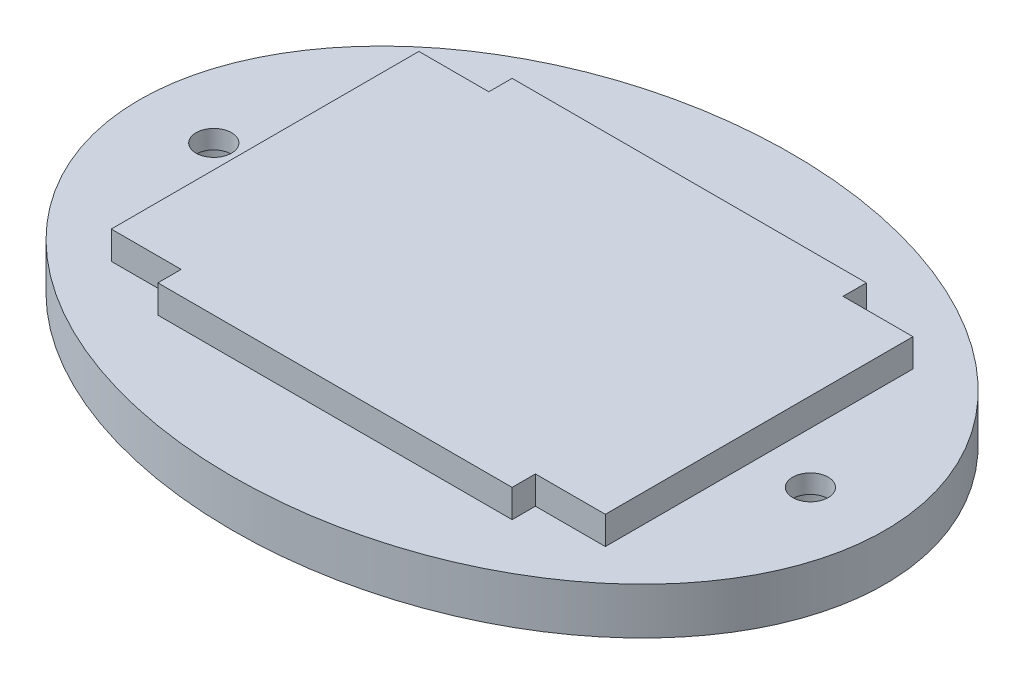
ISO-10303-21;
HEADER;
FILE_DESCRIPTION(('STEP AP214'),'2;1');
FILE_NAME('part.step','',(''),(''),'','','');
FILE_SCHEMA(('AUTOMOTIVE_DESIGN { 1 0 10303 214 1 1 1 1 }'));
ENDSEC;
DATA;
#1=APPLICATION_CONTEXT('core data for automotive mechanical design processes');
#2=APPLICATION_PROTOCOL_DEFINITION('international standard','automotive_design',2000,#1);
#3=PRODUCT_CONTEXT('',#1,'mechanical');
#4=PRODUCT('Part','Part','',(#3));
#5=PRODUCT_RELATED_PRODUCT_CATEGORY('part','',(#4));
#6=PRODUCT_DEFINITION_FORMATION('','',#4);
#7=PRODUCT_DEFINITION_CONTEXT('part definition',#1,'design');
#8=PRODUCT_DEFINITION('design','',#6,#7);
#9=PRODUCT_DEFINITION_SHAPE('','',#8);
#10=(LENGTH_UNIT() NAMED_UNIT(*) SI_UNIT(.MILLI.,.METRE.));
#11=(NAMED_UNIT(*) PLANE_ANGLE_UNIT() SI_UNIT($,.RADIAN.));
#12=(NAMED_UNIT(*) SI_UNIT($,.STERADIAN.) SOLID_ANGLE_UNIT());
#13=UNCERTAINTY_MEASURE_WITH_UNIT(LENGTH_MEASURE(1.E-05),#10,'distance_accuracy_value','');
#14=(GEOMETRIC_REPRESENTATION_CONTEXT(3) GLOBAL_UNCERTAINTY_ASSIGNED_CONTEXT((#13)) GLOBAL_UNIT_ASSIGNED_CONTEXT((#10,
#11,#12)) REPRESENTATION_CONTEXT('',''));
#15=CARTESIAN_POINT('',(0.,0.,0.));
#16=DIRECTION('',(0.,0.,1.));
#17=DIRECTION('',(1.,0.,0.));
#18=AXIS2_PLACEMENT_3D('',#15,#16,#17);
#19=CARTESIAN_POINT('',(-32.,10.,0.));
#20=DIRECTION('',(0.,-1.,0.));
#21=DIRECTION('',(0.,0.,-1.));
#22=AXIS2_PLACEMENT_3D('',#19,#20,#21);
#23=CYLINDRICAL_SURFACE('',#22,1.905);
#24=CARTESIAN_POINT('',(-32.,5.,0.));
#25=DIRECTION('',(0.,1.,0.));
#26=DIRECTION('',(0.,0.,1.));
#27=AXIS2_PLACEMENT_3D('',#24,#25,#26);
#28=CIRCLE('',#27,1.905);
#29=CARTESIAN_POINT('',(-32.,5.,1.905));
#30=VERTEX_POINT('',#29);
#31=EDGE_CURVE('E157',#30,#30,#28,.T.);
#32=ORIENTED_EDGE('',*,*,#31,.T.);
#33=EDGE_LOOP('',(#32));
#34=FACE_BOUND('',#33,.T.);
#35=CARTESIAN_POINT('',(-32.,3.,0.));
#36=DIRECTION('',(0.,-1.,0.));
#37=DIRECTION('',(0.,0.,-1.));
#38=AXIS2_PLACEMENT_3D('',#35,#36,#37);
#39=CIRCLE('',#38,1.905);
#40=CARTESIAN_POINT('',(-32.,3.,-1.905));
#41=VERTEX_POINT('',#40);
#42=EDGE_CURVE('E38',#41,#41,#39,.F.);
#43=ORIENTED_EDGE('',*,*,#42,.F.);
#44=EDGE_LOOP('',(#43));
#45=FACE_BOUND('',#44,.T.);
#46=ADVANCED_FACE('F33',(#34,#45),#23,.F.);
#47=CARTESIAN_POINT('',(32.,10.,0.));
#48=DIRECTION('',(0.,-1.,0.));
#49=DIRECTION('',(0.,0.,-1.));
#50=AXIS2_PLACEMENT_3D('',#47,#48,#49);
#51=CYLINDRICAL_SURFACE('',#50,1.905);
#52=CARTESIAN_POINT('',(32.,5.,0.));
#53=DIRECTION('',(0.,1.,0.));
#54=DIRECTION('',(0.,0.,1.));
#55=AXIS2_PLACEMENT_3D('',#52,#53,#54);
#56=CIRCLE('',#55,1.905);
#57=CARTESIAN_POINT('',(32.,5.,1.905));
#58=VERTEX_POINT('',#57);
#59=EDGE_CURVE('E174',#58,#58,#56,.T.);
#60=ORIENTED_EDGE('',*,*,#59,.T.);
#61=EDGE_LOOP('',(#60));
#62=FACE_BOUND('',#61,.T.);
#63=CARTESIAN_POINT('',(32.,3.,0.));
#64=DIRECTION('',(0.,-1.,0.));
#65=DIRECTION('',(0.,0.,-1.));
#66=AXIS2_PLACEMENT_3D('',#63,#64,#65);
#67=CIRCLE('',#66,1.905);
#68=CARTESIAN_POINT('',(32.,3.,-1.905));
#69=VERTEX_POINT('',#68);
#70=EDGE_CURVE('E151',#69,#69,#67,.F.);
#71=ORIENTED_EDGE('',*,*,#70,.F.);
#72=EDGE_LOOP('',(#71));
#73=FACE_BOUND('',#72,.T.);
#74=ADVANCED_FACE('F300',(#62,#73),#51,.F.);
#75=CARTESIAN_POINT('',(0.,5.,0.));
#76=DIRECTION('',(0.,1.,0.));
#77=DIRECTION('',(-1.,0.,0.));
#78=AXIS2_PLACEMENT_3D('',#75,#76,#77);
#79=ELLIPSE('',#78,40.,30.);
#80=DIRECTION('',(0.,-1.,0.));
#81=VECTOR('',#80,1.);
#82=SURFACE_OF_LINEAR_EXTRUSION('',#79,#81);
#83=CARTESIAN_POINT('',(-40.,5.,0.));
#84=VERTEX_POINT('',#83);
#85=EDGE_CURVE('E11',#84,#84,#79,.T.);
#86=ORIENTED_EDGE('',*,*,#85,.F.);
#87=EDGE_LOOP('',(#86));
#88=FACE_BOUND('',#87,.T.);
#89=CARTESIAN_POINT('',(0.,0.,0.));
#90=DIRECTION('',(0.,1.,0.));
#91=DIRECTION('',(-1.,0.,0.));
#92=AXIS2_PLACEMENT_3D('',#89,#90,#91);
#93=ELLIPSE('',#92,40.,30.);
#94=CARTESIAN_POINT('',(-40.,0.,0.));
#95=VERTEX_POINT('',#94);
#96=EDGE_CURVE('E43',#95,#95,#93,.T.);
#97=ORIENTED_EDGE('',*,*,#96,.T.);
#98=EDGE_LOOP('',(#97));
#99=FACE_BOUND('',#98,.T.);
#100=ADVANCED_FACE('F35',(#88,#99),#82,.F.);
#101=CARTESIAN_POINT('',(0.,5.,0.));
#102=DIRECTION('',(0.,1.,0.));
#103=DIRECTION('',(0.,0.,1.));
#104=AXIS2_PLACEMENT_3D('',#101,#102,#103);
#105=PLANE('',#104);
#106=ORIENTED_EDGE('',*,*,#59,.F.);
#107=EDGE_LOOP('',(#106));
#108=FACE_BOUND('',#107,.T.);
#109=ORIENTED_EDGE('',*,*,#31,.F.);
#110=EDGE_LOOP('',(#109));
#111=FACE_BOUND('',#110,.T.);
#112=DIRECTION('',(0.,0.,1.));
#113=VECTOR('',#112,1.);
#114=CARTESIAN_POINT('',(-19.,5.,-16.5));
#115=LINE('',#114,#113);
#116=CARTESIAN_POINT('',(-19.,5.,-19.));
#117=VERTEX_POINT('',#116);
#118=CARTESIAN_POINT('',(-19.,5.,-16.5));
#119=VERTEX_POINT('',#118);
#120=EDGE_CURVE('E50',#117,#119,#115,.T.);
#121=ORIENTED_EDGE('',*,*,#120,.F.);
#122=DIRECTION('',(-1.,0.,0.));
#123=VECTOR('',#122,1.);
#124=CARTESIAN_POINT('',(19.,5.,-19.));
#125=LINE('',#124,#123);
#126=CARTESIAN_POINT('',(19.,5.,-19.));
#127=VERTEX_POINT('',#126);
#128=EDGE_CURVE('E54',#127,#117,#125,.T.);
#129=ORIENTED_EDGE('',*,*,#128,.F.);
#130=DIRECTION('',(0.,0.,-1.));
#131=VECTOR('',#130,1.);
#132=CARTESIAN_POINT('',(19.,5.,-16.5));
#133=LINE('',#132,#131);
#134=CARTESIAN_POINT('',(19.,5.,-16.5));
#135=VERTEX_POINT('',#134);
#136=EDGE_CURVE('E223',#135,#127,#133,.T.);
#137=ORIENTED_EDGE('',*,*,#136,.F.);
#138=DIRECTION('',(-1.,0.,0.));
#139=VECTOR('',#138,1.);
#140=CARTESIAN_POINT('',(26.5,5.,-16.5));
#141=LINE('',#140,#139);
#142=CARTESIAN_POINT('',(26.5,5.,-16.5));
#143=VERTEX_POINT('',#142);
#144=EDGE_CURVE('E220',#143,#135,#141,.T.);
#145=ORIENTED_EDGE('',*,*,#144,.F.);
#146=DIRECTION('',(0.,0.,-1.));
#147=VECTOR('',#146,1.);
#148=CARTESIAN_POINT('',(26.5,5.,16.5));
#149=LINE('',#148,#147);
#150=CARTESIAN_POINT('',(26.5,5.,16.5));
#151=VERTEX_POINT('',#150);
#152=EDGE_CURVE('E217',#151,#143,#149,.T.);
#153=ORIENTED_EDGE('',*,*,#152,.F.);
#154=DIRECTION('',(1.,0.,0.));
#155=VECTOR('',#154,1.);
#156=CARTESIAN_POINT('',(26.5,5.,16.5));
#157=LINE('',#156,#155);
#158=CARTESIAN_POINT('',(19.,5.,16.5));
#159=VERTEX_POINT('',#158);
#160=EDGE_CURVE('E214',#159,#151,#157,.T.);
#161=ORIENTED_EDGE('',*,*,#160,.F.);
#162=DIRECTION('',(0.,0.,-1.));
#163=VECTOR('',#162,1.);
#164=CARTESIAN_POINT('',(19.,5.,19.));
#165=LINE('',#164,#163);
#166=CARTESIAN_POINT('',(19.,5.,19.));
#167=VERTEX_POINT('',#166);
#168=EDGE_CURVE('E211',#167,#159,#165,.T.);
#169=ORIENTED_EDGE('',*,*,#168,.F.);
#170=DIRECTION('',(1.,0.,0.));
#171=VECTOR('',#170,1.);
#172=CARTESIAN_POINT('',(19.,5.,19.));
#173=LINE('',#172,#171);
#174=CARTESIAN_POINT('',(-19.,5.,19.));
#175=VERTEX_POINT('',#174);
#176=EDGE_CURVE('E208',#175,#167,#173,.T.);
#177=ORIENTED_EDGE('',*,*,#176,.F.);
#178=DIRECTION('',(0.,0.,1.));
#179=VECTOR('',#178,1.);
#180=CARTESIAN_POINT('',(-19.,5.,19.));
#181=LINE('',#180,#179);
#182=CARTESIAN_POINT('',(-19.,5.,16.5));
#183=VERTEX_POINT('',#182);
#184=EDGE_CURVE('E205',#183,#175,#181,.T.);
#185=ORIENTED_EDGE('',*,*,#184,.F.);
#186=DIRECTION('',(1.,0.,0.));
#187=VECTOR('',#186,1.);
#188=CARTESIAN_POINT('',(-19.,5.,16.5));
#189=LINE('',#188,#187);
#190=CARTESIAN_POINT('',(-26.5,5.,16.5));
#191=VERTEX_POINT('',#190);
#192=EDGE_CURVE('E202',#191,#183,#189,.T.);
#193=ORIENTED_EDGE('',*,*,#192,.F.);
#194=DIRECTION('',(0.,0.,1.));
#195=VECTOR('',#194,1.);
#196=CARTESIAN_POINT('',(-26.5,5.,16.5));
#197=LINE('',#196,#195);
#198=CARTESIAN_POINT('',(-26.5,5.,-16.5));
#199=VERTEX_POINT('',#198);
#200=EDGE_CURVE('E199',#199,#191,#197,.T.);
#201=ORIENTED_EDGE('',*,*,#200,.F.);
#202=DIRECTION('',(-1.,0.,0.));
#203=VECTOR('',#202,1.);
#204=CARTESIAN_POINT('',(-19.,5.,-16.5));
#205=LINE('',#204,#203);
#206=EDGE_CURVE('E197',#119,#199,#205,.T.);
#207=ORIENTED_EDGE('',*,*,#206,.F.);
#208=EDGE_LOOP('',(#121,#129,#137,#145,#153,#161,#169,#177,#185,#193,#201,#207));
#209=FACE_BOUND('',#208,.T.);
#210=ORIENTED_EDGE('',*,*,#85,.T.);
#211=EDGE_LOOP('',(#210));
#212=FACE_BOUND('',#211,.T.);
#213=ADVANCED_FACE('F258',(#108,#111,#209,#212),#105,.T.);
#214=CARTESIAN_POINT('',(0.,0.,0.));
#215=DIRECTION('',(0.,1.,0.));
#216=DIRECTION('',(0.,0.,1.));
#217=AXIS2_PLACEMENT_3D('',#214,#215,#216);
#218=PLANE('',#217);
#219=CARTESIAN_POINT('',(-32.,0.,0.));
#220=DIRECTION('',(0.,-1.,0.));
#221=DIRECTION('',(0.,0.,-1.));
#222=AXIS2_PLACEMENT_3D('',#219,#220,#221);
#223=CIRCLE('',#222,3.405);
#224=CARTESIAN_POINT('',(-32.,0.,-3.405));
#225=VERTEX_POINT('',#224);
#226=EDGE_CURVE('E159',#225,#225,#223,.T.);
#227=ORIENTED_EDGE('',*,*,#226,.F.);
#228=EDGE_LOOP('',(#227));
#229=FACE_BOUND('',#228,.T.);
#230=CARTESIAN_POINT('',(32.,0.,0.));
#231=DIRECTION('',(0.,-1.,0.));
#232=DIRECTION('',(0.,0.,-1.));
#233=AXIS2_PLACEMENT_3D('',#230,#231,#232);
#234=CIRCLE('',#233,3.405);
#235=CARTESIAN_POINT('',(32.,0.,-3.405));
#236=VERTEX_POINT('',#235);
#237=EDGE_CURVE('E169',#236,#236,#234,.T.);
#238=ORIENTED_EDGE('',*,*,#237,.F.);
#239=EDGE_LOOP('',(#238));
#240=FACE_BOUND('',#239,.T.);
#241=ORIENTED_EDGE('',*,*,#96,.F.);
#242=EDGE_LOOP('',(#241));
#243=FACE_BOUND('',#242,.T.);
#244=ADVANCED_FACE('F442',(#229,#240,#243),#218,.F.);
#245=CARTESIAN_POINT('',(-19.,8.,-16.5));
#246=DIRECTION('',(1.,0.,0.));
#247=DIRECTION('',(0.,0.,-1.));
#248=AXIS2_PLACEMENT_3D('',#245,#246,#247);
#249=PLANE('',#248);
#250=ORIENTED_EDGE('',*,*,#120,.T.);
#251=DIRECTION('',(0.,-1.,0.));
#252=VECTOR('',#251,1.);
#253=CARTESIAN_POINT('',(-19.,8.,-16.5));
#254=LINE('',#253,#252);
#255=CARTESIAN_POINT('',(-19.,8.,-16.5));
#256=VERTEX_POINT('',#255);
#257=EDGE_CURVE('E127',#256,#119,#254,.T.);
#258=ORIENTED_EDGE('',*,*,#257,.F.);
#259=DIRECTION('',(0.,0.,1.));
#260=VECTOR('',#259,1.);
#261=CARTESIAN_POINT('',(-19.,8.,-16.5));
#262=LINE('',#261,#260);
#263=CARTESIAN_POINT('',(-19.,8.,-19.));
#264=VERTEX_POINT('',#263);
#265=EDGE_CURVE('E133',#264,#256,#262,.T.);
#266=ORIENTED_EDGE('',*,*,#265,.F.);
#267=DIRECTION('',(0.,-1.,0.));
#268=VECTOR('',#267,1.);
#269=CARTESIAN_POINT('',(-19.,8.,-19.));
#270=LINE('',#269,#268);
#271=EDGE_CURVE('E195',#264,#117,#270,.T.);
#272=ORIENTED_EDGE('',*,*,#271,.T.);
#273=EDGE_LOOP('',(#250,#258,#266,#272));
#274=FACE_BOUND('',#273,.T.);
#275=ADVANCED_FACE('F143',(#274),#249,.F.);
#276=CARTESIAN_POINT('',(-19.,8.,-16.5));
#277=DIRECTION('',(0.,0.,1.));
#278=DIRECTION('',(1.,0.,0.));
#279=AXIS2_PLACEMENT_3D('',#276,#277,#278);
#280=PLANE('',#279);
#281=ORIENTED_EDGE('',*,*,#206,.T.);
#282=DIRECTION('',(0.,-1.,0.));
#283=VECTOR('',#282,1.);
#284=CARTESIAN_POINT('',(-26.5,8.,-16.5));
#285=LINE('',#284,#283);
#286=CARTESIAN_POINT('',(-26.5,8.,-16.5));
#287=VERTEX_POINT('',#286);
#288=EDGE_CURVE('E129',#287,#199,#285,.T.);
#289=ORIENTED_EDGE('',*,*,#288,.F.);
#290=DIRECTION('',(-1.,0.,0.));
#291=VECTOR('',#290,1.);
#292=CARTESIAN_POINT('',(-19.,8.,-16.5));
#293=LINE('',#292,#291);
#294=EDGE_CURVE('E122',#256,#287,#293,.T.);
#295=ORIENTED_EDGE('',*,*,#294,.F.);
#296=ORIENTED_EDGE('',*,*,#257,.T.);
#297=EDGE_LOOP('',(#281,#289,#295,#296));
#298=FACE_BOUND('',#297,.T.);
#299=ADVANCED_FACE('F125',(#298),#280,.F.);
#300=CARTESIAN_POINT('',(-26.5,8.,16.5));
#301=DIRECTION('',(1.,0.,0.));
#302=DIRECTION('',(0.,0.,-1.));
#303=AXIS2_PLACEMENT_3D('',#300,#301,#302);
#304=PLANE('',#303);
#305=ORIENTED_EDGE('',*,*,#200,.T.);
#306=DIRECTION('',(0.,-1.,0.));
#307=VECTOR('',#306,1.);
#308=CARTESIAN_POINT('',(-26.5,8.,16.5));
#309=LINE('',#308,#307);
#310=CARTESIAN_POINT('',(-26.5,8.,16.5));
#311=VERTEX_POINT('',#310);
#312=EDGE_CURVE('E147',#311,#191,#309,.T.);
#313=ORIENTED_EDGE('',*,*,#312,.F.);
#314=DIRECTION('',(0.,0.,1.));
#315=VECTOR('',#314,1.);
#316=CARTESIAN_POINT('',(-26.5,8.,16.5));
#317=LINE('',#316,#315);
#318=EDGE_CURVE('E132',#287,#311,#317,.T.);
#319=ORIENTED_EDGE('',*,*,#318,.F.);
#320=ORIENTED_EDGE('',*,*,#288,.T.);
#321=EDGE_LOOP('',(#305,#313,#319,#320));
#322=FACE_BOUND('',#321,.T.);
#323=ADVANCED_FACE('F257',(#322),#304,.F.);
#324=CARTESIAN_POINT('',(-19.,8.,16.5));
#325=DIRECTION('',(0.,0.,-1.));
#326=DIRECTION('',(-1.,0.,0.));
#327=AXIS2_PLACEMENT_3D('',#324,#325,#326);
#328=PLANE('',#327);
#329=ORIENTED_EDGE('',*,*,#192,.T.);
#330=DIRECTION('',(0.,-1.,0.));
#331=VECTOR('',#330,1.);
#332=CARTESIAN_POINT('',(-19.,8.,16.5));
#333=LINE('',#332,#331);
#334=CARTESIAN_POINT('',(-19.,8.,16.5));
#335=VERTEX_POINT('',#334);
#336=EDGE_CURVE('E248',#335,#183,#333,.T.);
#337=ORIENTED_EDGE('',*,*,#336,.F.);
#338=DIRECTION('',(1.,0.,0.));
#339=VECTOR('',#338,1.);
#340=CARTESIAN_POINT('',(-19.,8.,16.5));
#341=LINE('',#340,#339);
#342=EDGE_CURVE('E178',#311,#335,#341,.T.);
#343=ORIENTED_EDGE('',*,*,#342,.F.);
#344=ORIENTED_EDGE('',*,*,#312,.T.);
#345=EDGE_LOOP('',(#329,#337,#343,#344));
#346=FACE_BOUND('',#345,.T.);
#347=ADVANCED_FACE('F254',(#346),#328,.F.);
#348=CARTESIAN_POINT('',(-19.,8.,19.));
#349=DIRECTION('',(1.,0.,0.));
#350=DIRECTION('',(0.,0.,-1.));
#351=AXIS2_PLACEMENT_3D('',#348,#349,#350);
#352=PLANE('',#351);
#353=ORIENTED_EDGE('',*,*,#184,.T.);
#354=DIRECTION('',(0.,-1.,0.));
#355=VECTOR('',#354,1.);
#356=CARTESIAN_POINT('',(-19.,8.,19.));
#357=LINE('',#356,#355);
#358=CARTESIAN_POINT('',(-19.,8.,19.));
#359=VERTEX_POINT('',#358);
#360=EDGE_CURVE('E245',#359,#175,#357,.T.);
#361=ORIENTED_EDGE('',*,*,#360,.F.);
#362=DIRECTION('',(0.,0.,1.));
#363=VECTOR('',#362,1.);
#364=CARTESIAN_POINT('',(-19.,8.,19.));
#365=LINE('',#364,#363);
#366=EDGE_CURVE('E180',#335,#359,#365,.T.);
#367=ORIENTED_EDGE('',*,*,#366,.F.);
#368=ORIENTED_EDGE('',*,*,#336,.T.);
#369=EDGE_LOOP('',(#353,#361,#367,#368));
#370=FACE_BOUND('',#369,.T.);
#371=ADVANCED_FACE('F262',(#370),#352,.F.);
#372=CARTESIAN_POINT('',(19.,8.,19.));
#373=DIRECTION('',(0.,0.,-1.));
#374=DIRECTION('',(-1.,0.,0.));
#375=AXIS2_PLACEMENT_3D('',#372,#373,#374);
#376=PLANE('',#375);
#377=ORIENTED_EDGE('',*,*,#176,.T.);
#378=DIRECTION('',(0.,-1.,0.));
#379=VECTOR('',#378,1.);
#380=CARTESIAN_POINT('',(19.,8.,19.));
#381=LINE('',#380,#379);
#382=CARTESIAN_POINT('',(19.,8.,19.));
#383=VERTEX_POINT('',#382);
#384=EDGE_CURVE('E242',#383,#167,#381,.T.);
#385=ORIENTED_EDGE('',*,*,#384,.F.);
#386=DIRECTION('',(1.,0.,0.));
#387=VECTOR('',#386,1.);
#388=CARTESIAN_POINT('',(19.,8.,19.));
#389=LINE('',#388,#387);
#390=EDGE_CURVE('E182',#359,#383,#389,.T.);
#391=ORIENTED_EDGE('',*,*,#390,.F.);
#392=ORIENTED_EDGE('',*,*,#360,.T.);
#393=EDGE_LOOP('',(#377,#385,#391,#392));
#394=FACE_BOUND('',#393,.T.);
#395=ADVANCED_FACE('F266',(#394),#376,.F.);
#396=CARTESIAN_POINT('',(19.,8.,19.));
#397=DIRECTION('',(-1.,0.,0.));
#398=DIRECTION('',(0.,0.,1.));
#399=AXIS2_PLACEMENT_3D('',#396,#397,#398);
#400=PLANE('',#399);
#401=ORIENTED_EDGE('',*,*,#168,.T.);
#402=DIRECTION('',(0.,-1.,0.));
#403=VECTOR('',#402,1.);
#404=CARTESIAN_POINT('',(19.,8.,16.5));
#405=LINE('',#404,#403);
#406=CARTESIAN_POINT('',(19.,8.,16.5));
#407=VERTEX_POINT('',#406);
#408=EDGE_CURVE('E239',#407,#159,#405,.T.);
#409=ORIENTED_EDGE('',*,*,#408,.F.);
#410=DIRECTION('',(0.,0.,-1.));
#411=VECTOR('',#410,1.);
#412=CARTESIAN_POINT('',(19.,8.,19.));
#413=LINE('',#412,#411);
#414=EDGE_CURVE('E184',#383,#407,#413,.T.);
#415=ORIENTED_EDGE('',*,*,#414,.F.);
#416=ORIENTED_EDGE('',*,*,#384,.T.);
#417=EDGE_LOOP('',(#401,#409,#415,#416));
#418=FACE_BOUND('',#417,.T.);
#419=ADVANCED_FACE('F273',(#418),#400,.F.);
#420=CARTESIAN_POINT('',(26.5,8.,16.5));
#421=DIRECTION('',(0.,0.,-1.));
#422=DIRECTION('',(-1.,0.,0.));
#423=AXIS2_PLACEMENT_3D('',#420,#421,#422);
#424=PLANE('',#423);
#425=ORIENTED_EDGE('',*,*,#160,.T.);
#426=DIRECTION('',(0.,-1.,0.));
#427=VECTOR('',#426,1.);
#428=CARTESIAN_POINT('',(26.5,8.,16.5));
#429=LINE('',#428,#427);
#430=CARTESIAN_POINT('',(26.5,8.,16.5));
#431=VERTEX_POINT('',#430);
#432=EDGE_CURVE('E236',#431,#151,#429,.T.);
#433=ORIENTED_EDGE('',*,*,#432,.F.);
#434=DIRECTION('',(1.,0.,0.));
#435=VECTOR('',#434,1.);
#436=CARTESIAN_POINT('',(26.5,8.,16.5));
#437=LINE('',#436,#435);
#438=EDGE_CURVE('E186',#407,#431,#437,.T.);
#439=ORIENTED_EDGE('',*,*,#438,.F.);
#440=ORIENTED_EDGE('',*,*,#408,.T.);
#441=EDGE_LOOP('',(#425,#433,#439,#440));
#442=FACE_BOUND('',#441,.T.);
#443=ADVANCED_FACE('F275',(#442),#424,.F.);
#444=CARTESIAN_POINT('',(26.5,8.,16.5));
#445=DIRECTION('',(-1.,0.,0.));
#446=DIRECTION('',(0.,0.,1.));
#447=AXIS2_PLACEMENT_3D('',#444,#445,#446);
#448=PLANE('',#447);
#449=ORIENTED_EDGE('',*,*,#152,.T.);
#450=DIRECTION('',(0.,-1.,0.));
#451=VECTOR('',#450,1.);
#452=CARTESIAN_POINT('',(26.5,8.,-16.5));
#453=LINE('',#452,#451);
#454=CARTESIAN_POINT('',(26.5,8.,-16.5));
#455=VERTEX_POINT('',#454);
#456=EDGE_CURVE('E233',#455,#143,#453,.T.);
#457=ORIENTED_EDGE('',*,*,#456,.F.);
#458=DIRECTION('',(0.,0.,-1.));
#459=VECTOR('',#458,1.);
#460=CARTESIAN_POINT('',(26.5,8.,16.5));
#461=LINE('',#460,#459);
#462=EDGE_CURVE('E188',#431,#455,#461,.T.);
#463=ORIENTED_EDGE('',*,*,#462,.F.);
#464=ORIENTED_EDGE('',*,*,#432,.T.);
#465=EDGE_LOOP('',(#449,#457,#463,#464));
#466=FACE_BOUND('',#465,.T.);
#467=ADVANCED_FACE('F279',(#466),#448,.F.);
#468=CARTESIAN_POINT('',(26.5,8.,-16.5));
#469=DIRECTION('',(0.,0.,1.));
#470=DIRECTION('',(1.,0.,0.));
#471=AXIS2_PLACEMENT_3D('',#468,#469,#470);
#472=PLANE('',#471);
#473=ORIENTED_EDGE('',*,*,#144,.T.);
#474=DIRECTION('',(0.,-1.,0.));
#475=VECTOR('',#474,1.);
#476=CARTESIAN_POINT('',(19.,8.,-16.5));
#477=LINE('',#476,#475);
#478=CARTESIAN_POINT('',(19.,8.,-16.5));
#479=VERTEX_POINT('',#478);
#480=EDGE_CURVE('E230',#479,#135,#477,.T.);
#481=ORIENTED_EDGE('',*,*,#480,.F.);
#482=DIRECTION('',(-1.,0.,0.));
#483=VECTOR('',#482,1.);
#484=CARTESIAN_POINT('',(26.5,8.,-16.5));
#485=LINE('',#484,#483);
#486=EDGE_CURVE('E190',#455,#479,#485,.T.);
#487=ORIENTED_EDGE('',*,*,#486,.F.);
#488=ORIENTED_EDGE('',*,*,#456,.T.);
#489=EDGE_LOOP('',(#473,#481,#487,#488));
#490=FACE_BOUND('',#489,.T.);
#491=ADVANCED_FACE('F285',(#490),#472,.F.);
#492=CARTESIAN_POINT('',(19.,8.,-16.5));
#493=DIRECTION('',(-1.,0.,0.));
#494=DIRECTION('',(0.,0.,1.));
#495=AXIS2_PLACEMENT_3D('',#492,#493,#494);
#496=PLANE('',#495);
#497=ORIENTED_EDGE('',*,*,#136,.T.);
#498=DIRECTION('',(0.,-1.,0.));
#499=VECTOR('',#498,1.);
#500=CARTESIAN_POINT('',(19.,8.,-19.));
#501=LINE('',#500,#499);
#502=CARTESIAN_POINT('',(19.,8.,-19.));
#503=VERTEX_POINT('',#502);
#504=EDGE_CURVE('E227',#503,#127,#501,.T.);
#505=ORIENTED_EDGE('',*,*,#504,.F.);
#506=DIRECTION('',(0.,0.,-1.));
#507=VECTOR('',#506,1.);
#508=CARTESIAN_POINT('',(19.,8.,-16.5));
#509=LINE('',#508,#507);
#510=EDGE_CURVE('E192',#479,#503,#509,.T.);
#511=ORIENTED_EDGE('',*,*,#510,.F.);
#512=ORIENTED_EDGE('',*,*,#480,.T.);
#513=EDGE_LOOP('',(#497,#505,#511,#512));
#514=FACE_BOUND('',#513,.T.);
#515=ADVANCED_FACE('F287',(#514),#496,.F.);
#516=CARTESIAN_POINT('',(19.,8.,-19.));
#517=DIRECTION('',(0.,0.,1.));
#518=DIRECTION('',(1.,0.,0.));
#519=AXIS2_PLACEMENT_3D('',#516,#517,#518);
#520=PLANE('',#519);
#521=ORIENTED_EDGE('',*,*,#128,.T.);
#522=ORIENTED_EDGE('',*,*,#271,.F.);
#523=DIRECTION('',(-1.,0.,0.));
#524=VECTOR('',#523,1.);
#525=CARTESIAN_POINT('',(19.,8.,-19.));
#526=LINE('',#525,#524);
#527=EDGE_CURVE('E138',#503,#264,#526,.T.);
#528=ORIENTED_EDGE('',*,*,#527,.F.);
#529=ORIENTED_EDGE('',*,*,#504,.T.);
#530=EDGE_LOOP('',(#521,#522,#528,#529));
#531=FACE_BOUND('',#530,.T.);
#532=ADVANCED_FACE('F289',(#531),#520,.F.);
#533=CARTESIAN_POINT('',(0.,8.,0.));
#534=DIRECTION('',(0.,1.,0.));
#535=DIRECTION('',(0.,0.,1.));
#536=AXIS2_PLACEMENT_3D('',#533,#534,#535);
#537=PLANE('',#536);
#538=ORIENTED_EDGE('',*,*,#265,.T.);
#539=ORIENTED_EDGE('',*,*,#294,.T.);
#540=ORIENTED_EDGE('',*,*,#318,.T.);
#541=ORIENTED_EDGE('',*,*,#342,.T.);
#542=ORIENTED_EDGE('',*,*,#366,.T.);
#543=ORIENTED_EDGE('',*,*,#390,.T.);
#544=ORIENTED_EDGE('',*,*,#414,.T.);
#545=ORIENTED_EDGE('',*,*,#438,.T.);
#546=ORIENTED_EDGE('',*,*,#462,.T.);
#547=ORIENTED_EDGE('',*,*,#486,.T.);
#548=ORIENTED_EDGE('',*,*,#510,.T.);
#549=ORIENTED_EDGE('',*,*,#527,.T.);
#550=EDGE_LOOP('',(#538,#539,#540,#541,#542,#543,#544,#545,#546,#547,#548,#549));
#551=FACE_BOUND('',#550,.T.);
#552=ADVANCED_FACE('F136',(#551),#537,.T.);
#553=CARTESIAN_POINT('',(32.,3.,0.));
#554=DIRECTION('',(0.,-1.,0.));
#555=DIRECTION('',(0.,0.,-1.));
#556=AXIS2_PLACEMENT_3D('',#553,#554,#555);
#557=PLANE('',#556);
#558=CARTESIAN_POINT('',(32.,3.,0.));
#559=DIRECTION('',(0.,-1.,0.));
#560=DIRECTION('',(0.,0.,-1.));
#561=AXIS2_PLACEMENT_3D('',#558,#559,#560);
#562=CIRCLE('',#561,3.405);
#563=CARTESIAN_POINT('',(32.,3.,-3.405));
#564=VERTEX_POINT('',#563);
#565=EDGE_CURVE('E164',#564,#564,#562,.T.);
#566=ORIENTED_EDGE('',*,*,#565,.T.);
#567=EDGE_LOOP('',(#566));
#568=FACE_BOUND('',#567,.T.);
#569=ORIENTED_EDGE('',*,*,#70,.T.);
#570=EDGE_LOOP('',(#569));
#571=FACE_BOUND('',#570,.T.);
#572=ADVANCED_FACE('F296',(#568,#571),#557,.T.);
#573=CARTESIAN_POINT('',(32.,3.,0.));
#574=DIRECTION('',(0.,-1.,0.));
#575=DIRECTION('',(0.,0.,-1.));
#576=AXIS2_PLACEMENT_3D('',#573,#574,#575);
#577=CYLINDRICAL_SURFACE('',#576,3.405);
#578=ORIENTED_EDGE('',*,*,#565,.F.);
#579=EDGE_LOOP('',(#578));
#580=FACE_BOUND('',#579,.T.);
#581=ORIENTED_EDGE('',*,*,#237,.T.);
#582=EDGE_LOOP('',(#581));
#583=FACE_BOUND('',#582,.T.);
#584=ADVANCED_FACE('F310',(#580,#583),#577,.F.);
#585=CARTESIAN_POINT('',(-32.,3.,0.));
#586=DIRECTION('',(0.,-1.,0.));
#587=DIRECTION('',(0.,0.,-1.));
#588=AXIS2_PLACEMENT_3D('',#585,#586,#587);
#589=PLANE('',#588);
#590=CARTESIAN_POINT('',(-32.,3.,0.));
#591=DIRECTION('',(0.,-1.,0.));
#592=DIRECTION('',(0.,0.,-1.));
#593=AXIS2_PLACEMENT_3D('',#590,#591,#592);
#594=CIRCLE('',#593,3.405);
#595=CARTESIAN_POINT('',(-32.,3.,-3.405));
#596=VERTEX_POINT('',#595);
#597=EDGE_CURVE('E153',#596,#596,#594,.T.);
#598=ORIENTED_EDGE('',*,*,#597,.T.);
#599=EDGE_LOOP('',(#598));
#600=FACE_BOUND('',#599,.T.);
#601=ORIENTED_EDGE('',*,*,#42,.T.);
#602=EDGE_LOOP('',(#601));
#603=FACE_BOUND('',#602,.T.);
#604=ADVANCED_FACE('F313',(#600,#603),#589,.T.);
#605=CARTESIAN_POINT('',(-32.,3.,0.));
#606=DIRECTION('',(0.,-1.,0.));
#607=DIRECTION('',(0.,0.,-1.));
#608=AXIS2_PLACEMENT_3D('',#605,#606,#607);
#609=CYLINDRICAL_SURFACE('',#608,3.405);
#610=ORIENTED_EDGE('',*,*,#597,.F.);
#611=EDGE_LOOP('',(#610));
#612=FACE_BOUND('',#611,.T.);
#613=ORIENTED_EDGE('',*,*,#226,.T.);
#614=EDGE_LOOP('',(#613));
#615=FACE_BOUND('',#614,.T.);
#616=ADVANCED_FACE('F318',(#612,#615),#609,.F.);
#617=CLOSED_SHELL('',(#46,#74,#100,#213,#244,#275,#299,#323,#347,#371,#395,#419,#443,#467,#491,
#515,#532,#552,#572,#584,#604,#616));
#618=MANIFOLD_SOLID_BREP('B2',#617);
#619=ADVANCED_BREP_SHAPE_REPRESENTATION('',(#18,#618),#14);
#620=SHAPE_DEFINITION_REPRESENTATION(#9,#619);
ENDSEC;
END-ISO-10303-21;
